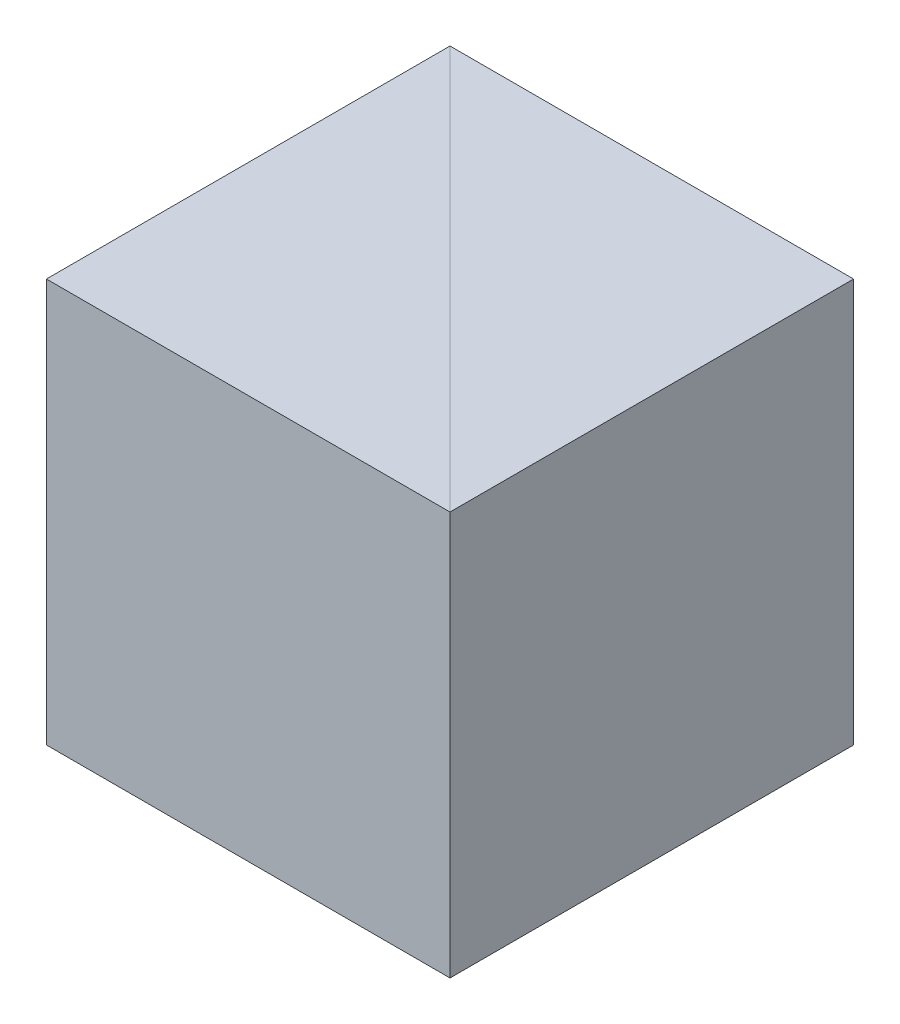
ISO-10303-21;
HEADER;
FILE_DESCRIPTION(('STEP AP214'),'2;1');
FILE_NAME('part.step','',(''),(''),'','','');
FILE_SCHEMA(('AUTOMOTIVE_DESIGN { 1 0 10303 214 1 1 1 1 }'));
ENDSEC;
DATA;
#1=APPLICATION_CONTEXT('core data for automotive mechanical design processes');
#2=APPLICATION_PROTOCOL_DEFINITION('international standard','automotive_design',2000,#1);
#3=PRODUCT_CONTEXT('',#1,'mechanical');
#4=PRODUCT('Part','Part','',(#3));
#5=PRODUCT_RELATED_PRODUCT_CATEGORY('part','',(#4));
#6=PRODUCT_DEFINITION_FORMATION('','',#4);
#7=PRODUCT_DEFINITION_CONTEXT('part definition',#1,'design');
#8=PRODUCT_DEFINITION('design','',#6,#7);
#9=PRODUCT_DEFINITION_SHAPE('','',#8);
#10=(LENGTH_UNIT() NAMED_UNIT(*) SI_UNIT(.MILLI.,.METRE.));
#11=(NAMED_UNIT(*) PLANE_ANGLE_UNIT() SI_UNIT($,.RADIAN.));
#12=(NAMED_UNIT(*) SI_UNIT($,.STERADIAN.) SOLID_ANGLE_UNIT());
#13=UNCERTAINTY_MEASURE_WITH_UNIT(LENGTH_MEASURE(1.E-05),#10,'distance_accuracy_value','');
#14=(GEOMETRIC_REPRESENTATION_CONTEXT(3) GLOBAL_UNCERTAINTY_ASSIGNED_CONTEXT((#13)) GLOBAL_UNIT_ASSIGNED_CONTEXT((#10,
#11,#12)) REPRESENTATION_CONTEXT('',''));
#15=CARTESIAN_POINT('',(0.,0.,0.));
#16=DIRECTION('',(0.,0.,1.));
#17=DIRECTION('',(1.,0.,0.));
#18=AXIS2_PLACEMENT_3D('',#15,#16,#17);
#19=CARTESIAN_POINT('',(0.,25.,0.));
#20=DIRECTION('',(0.707106781186547,0.,-0.707106781186547));
#21=DIRECTION('',(-0.707106781186548,0.,-0.707106781186548));
#22=AXIS2_PLACEMENT_3D('',#19,#20,#21);
#23=PLANE('',#22);
#24=DIRECTION('',(0.707106781186547,0.,0.707106781186547));
#25=VECTOR('',#24,1.);
#26=CARTESIAN_POINT('',(0.,0.,0.));
#27=LINE('',#26,#25);
#28=CARTESIAN_POINT('',(-25.,0.,-25.));
#29=VERTEX_POINT('',#28);
#30=CARTESIAN_POINT('',(0.,0.,0.));
#31=VERTEX_POINT('',#30);
#32=EDGE_CURVE('E99',#29,#31,#27,.T.);
#33=ORIENTED_EDGE('',*,*,#32,.F.);
#34=DIRECTION('',(0.,-1.,0.));
#35=VECTOR('',#34,1.);
#36=CARTESIAN_POINT('',(-25.,25.,-25.));
#37=LINE('',#36,#35);
#38=CARTESIAN_POINT('',(-25.,25.,-25.));
#39=VERTEX_POINT('',#38);
#40=EDGE_CURVE('E12',#39,#29,#37,.T.);
#41=ORIENTED_EDGE('',*,*,#40,.F.);
#42=DIRECTION('',(0.707106781186547,0.,0.707106781186547));
#43=VECTOR('',#42,1.);
#44=CARTESIAN_POINT('',(0.,25.,0.));
#45=LINE('',#44,#43);
#46=CARTESIAN_POINT('',(0.,25.,0.));
#47=VERTEX_POINT('',#46);
#48=EDGE_CURVE('E91',#39,#47,#45,.T.);
#49=ORIENTED_EDGE('',*,*,#48,.T.);
#50=DIRECTION('',(0.,-1.,0.));
#51=VECTOR('',#50,1.);
#52=CARTESIAN_POINT('',(0.,25.,0.));
#53=LINE('',#52,#51);
#54=EDGE_CURVE('E50',#47,#31,#53,.T.);
#55=ORIENTED_EDGE('',*,*,#54,.T.);
#56=EDGE_LOOP('',(#33,#41,#49,#55));
#57=FACE_BOUND('',#56,.T.);
#58=ADVANCED_FACE('F47',(#57),#23,.T.);
#59=CARTESIAN_POINT('',(-25.,25.,-25.));
#60=DIRECTION('',(-1.,0.,0.));
#61=DIRECTION('',(0.,0.,1.));
#62=AXIS2_PLACEMENT_3D('',#59,#60,#61);
#63=PLANE('',#62);
#64=DIRECTION('',(0.,0.,-1.));
#65=VECTOR('',#64,1.);
#66=CARTESIAN_POINT('',(-25.,0.,-25.));
#67=LINE('',#66,#65);
#68=CARTESIAN_POINT('',(-25.,0.,0.));
#69=VERTEX_POINT('',#68);
#70=EDGE_CURVE('E93',#69,#29,#67,.T.);
#71=ORIENTED_EDGE('',*,*,#70,.F.);
#72=DIRECTION('',(0.,-1.,0.));
#73=VECTOR('',#72,1.);
#74=CARTESIAN_POINT('',(-25.,25.,0.));
#75=LINE('',#74,#73);
#76=CARTESIAN_POINT('',(-25.,25.,0.));
#77=VERTEX_POINT('',#76);
#78=EDGE_CURVE('E56',#77,#69,#75,.T.);
#79=ORIENTED_EDGE('',*,*,#78,.F.);
#80=DIRECTION('',(0.,0.,-1.));
#81=VECTOR('',#80,1.);
#82=CARTESIAN_POINT('',(-25.,25.,-25.));
#83=LINE('',#82,#81);
#84=EDGE_CURVE('E88',#77,#39,#83,.T.);
#85=ORIENTED_EDGE('',*,*,#84,.T.);
#86=ORIENTED_EDGE('',*,*,#40,.T.);
#87=EDGE_LOOP('',(#71,#79,#85,#86));
#88=FACE_BOUND('',#87,.T.);
#89=ADVANCED_FACE('F103',(#88),#63,.T.);
#90=CARTESIAN_POINT('',(-25.,25.,0.));
#91=DIRECTION('',(0.,0.,1.));
#92=DIRECTION('',(1.,0.,0.));
#93=AXIS2_PLACEMENT_3D('',#90,#91,#92);
#94=PLANE('',#93);
#95=DIRECTION('',(-1.,0.,0.));
#96=VECTOR('',#95,1.);
#97=CARTESIAN_POINT('',(-25.,0.,0.));
#98=LINE('',#97,#96);
#99=EDGE_CURVE('E86',#31,#69,#98,.T.);
#100=ORIENTED_EDGE('',*,*,#99,.F.);
#101=ORIENTED_EDGE('',*,*,#54,.F.);
#102=DIRECTION('',(-1.,0.,0.));
#103=VECTOR('',#102,1.);
#104=CARTESIAN_POINT('',(-25.,25.,0.));
#105=LINE('',#104,#103);
#106=EDGE_CURVE('E84',#47,#77,#105,.T.);
#107=ORIENTED_EDGE('',*,*,#106,.T.);
#108=ORIENTED_EDGE('',*,*,#78,.T.);
#109=EDGE_LOOP('',(#100,#101,#107,#108));
#110=FACE_BOUND('',#109,.T.);
#111=ADVANCED_FACE('F83',(#110),#94,.T.);
#112=CARTESIAN_POINT('',(0.,25.,0.));
#113=DIRECTION('',(0.,1.,0.));
#114=DIRECTION('',(0.,0.,1.));
#115=AXIS2_PLACEMENT_3D('',#112,#113,#114);
#116=PLANE('',#115);
#117=ORIENTED_EDGE('',*,*,#48,.F.);
#118=ORIENTED_EDGE('',*,*,#84,.F.);
#119=ORIENTED_EDGE('',*,*,#106,.F.);
#120=EDGE_LOOP('',(#117,#118,#119));
#121=FACE_BOUND('',#120,.T.);
#122=ADVANCED_FACE('F90',(#121),#116,.T.);
#123=CARTESIAN_POINT('',(0.,0.,0.));
#124=DIRECTION('',(0.,1.,0.));
#125=DIRECTION('',(0.,0.,1.));
#126=AXIS2_PLACEMENT_3D('',#123,#124,#125);
#127=PLANE('',#126);
#128=ORIENTED_EDGE('',*,*,#32,.T.);
#129=ORIENTED_EDGE('',*,*,#99,.T.);
#130=ORIENTED_EDGE('',*,*,#70,.T.);
#131=EDGE_LOOP('',(#128,#129,#130));
#132=FACE_BOUND('',#131,.T.);
#133=ADVANCED_FACE('F102',(#132),#127,.F.);
#134=CLOSED_SHELL('',(#58,#89,#111,#122,#133));
#135=MANIFOLD_SOLID_BREP('B2',#134);
#136=CARTESIAN_POINT('',(-25.,25.,-25.));
#137=DIRECTION('',(0.707106781186547,0.,-0.707106781186547));
#138=DIRECTION('',(-0.707106781186548,0.,-0.707106781186548));
#139=AXIS2_PLACEMENT_3D('',#136,#137,#138);
#140=PLANE('',#139);
#141=DIRECTION('',(0.707106781186547,0.,0.707106781186547));
#142=VECTOR('',#141,1.);
#143=CARTESIAN_POINT('',(-25.,0.,-25.));
#144=LINE('',#143,#142);
#145=CARTESIAN_POINT('',(-25.,0.,-25.));
#146=VERTEX_POINT('',#145);
#147=CARTESIAN_POINT('',(0.,0.,0.));
#148=VERTEX_POINT('',#147);
#149=EDGE_CURVE('E192',#146,#148,#144,.T.);
#150=ORIENTED_EDGE('',*,*,#149,.T.);
#151=DIRECTION('',(0.,-1.,0.));
#152=VECTOR('',#151,1.);
#153=CARTESIAN_POINT('',(0.,25.,0.));
#154=LINE('',#153,#152);
#155=CARTESIAN_POINT('',(0.,25.,0.));
#156=VERTEX_POINT('',#155);
#157=EDGE_CURVE('E45',#156,#148,#154,.T.);
#158=ORIENTED_EDGE('',*,*,#157,.F.);
#159=DIRECTION('',(0.707106781186547,0.,0.707106781186547));
#160=VECTOR('',#159,1.);
#161=CARTESIAN_POINT('',(-25.,25.,-25.));
#162=LINE('',#161,#160);
#163=CARTESIAN_POINT('',(-25.,25.,-25.));
#164=VERTEX_POINT('',#163);
#165=EDGE_CURVE('E185',#164,#156,#162,.T.);
#166=ORIENTED_EDGE('',*,*,#165,.F.);
#167=DIRECTION('',(0.,-1.,0.));
#168=VECTOR('',#167,1.);
#169=CARTESIAN_POINT('',(-25.,25.,-25.));
#170=LINE('',#169,#168);
#171=EDGE_CURVE('E193',#164,#146,#170,.T.);
#172=ORIENTED_EDGE('',*,*,#171,.T.);
#173=EDGE_LOOP('',(#150,#158,#166,#172));
#174=FACE_BOUND('',#173,.T.);
#175=ADVANCED_FACE('F145',(#174),#140,.F.);
#176=CARTESIAN_POINT('',(0.,25.,0.));
#177=DIRECTION('',(-1.,0.,0.));
#178=DIRECTION('',(0.,0.,1.));
#179=AXIS2_PLACEMENT_3D('',#176,#177,#178);
#180=PLANE('',#179);
#181=DIRECTION('',(0.,0.,-1.));
#182=VECTOR('',#181,1.);
#183=CARTESIAN_POINT('',(0.,0.,0.));
#184=LINE('',#183,#182);
#185=CARTESIAN_POINT('',(0.,0.,-25.));
#186=VERTEX_POINT('',#185);
#187=EDGE_CURVE('E173',#148,#186,#184,.T.);
#188=ORIENTED_EDGE('',*,*,#187,.T.);
#189=DIRECTION('',(0.,-1.,0.));
#190=VECTOR('',#189,1.);
#191=CARTESIAN_POINT('',(0.,25.,-25.));
#192=LINE('',#191,#190);
#193=CARTESIAN_POINT('',(0.,25.,-25.));
#194=VERTEX_POINT('',#193);
#195=EDGE_CURVE('E153',#194,#186,#192,.T.);
#196=ORIENTED_EDGE('',*,*,#195,.F.);
#197=DIRECTION('',(0.,0.,-1.));
#198=VECTOR('',#197,1.);
#199=CARTESIAN_POINT('',(0.,25.,0.));
#200=LINE('',#199,#198);
#201=EDGE_CURVE('E181',#156,#194,#200,.T.);
#202=ORIENTED_EDGE('',*,*,#201,.F.);
#203=ORIENTED_EDGE('',*,*,#157,.T.);
#204=EDGE_LOOP('',(#188,#196,#202,#203));
#205=FACE_BOUND('',#204,.T.);
#206=ADVANCED_FACE('F182',(#205),#180,.F.);
#207=CARTESIAN_POINT('',(0.,25.,-25.));
#208=DIRECTION('',(0.,0.,1.));
#209=DIRECTION('',(1.,0.,0.));
#210=AXIS2_PLACEMENT_3D('',#207,#208,#209);
#211=PLANE('',#210);
#212=DIRECTION('',(-1.,0.,0.));
#213=VECTOR('',#212,1.);
#214=CARTESIAN_POINT('',(0.,0.,-25.));
#215=LINE('',#214,#213);
#216=EDGE_CURVE('E178',#186,#146,#215,.T.);
#217=ORIENTED_EDGE('',*,*,#216,.T.);
#218=ORIENTED_EDGE('',*,*,#171,.F.);
#219=DIRECTION('',(-1.,0.,0.));
#220=VECTOR('',#219,1.);
#221=CARTESIAN_POINT('',(0.,25.,-25.));
#222=LINE('',#221,#220);
#223=EDGE_CURVE('E161',#194,#164,#222,.T.);
#224=ORIENTED_EDGE('',*,*,#223,.F.);
#225=ORIENTED_EDGE('',*,*,#195,.T.);
#226=EDGE_LOOP('',(#217,#218,#224,#225));
#227=FACE_BOUND('',#226,.T.);
#228=ADVANCED_FACE('F200',(#227),#211,.F.);
#229=CARTESIAN_POINT('',(0.,25.,0.));
#230=DIRECTION('',(0.,1.,0.));
#231=DIRECTION('',(0.,0.,1.));
#232=AXIS2_PLACEMENT_3D('',#229,#230,#231);
#233=PLANE('',#232);
#234=ORIENTED_EDGE('',*,*,#165,.T.);
#235=ORIENTED_EDGE('',*,*,#201,.T.);
#236=ORIENTED_EDGE('',*,*,#223,.T.);
#237=EDGE_LOOP('',(#234,#235,#236));
#238=FACE_BOUND('',#237,.T.);
#239=ADVANCED_FACE('F188',(#238),#233,.T.);
#240=CARTESIAN_POINT('',(0.,0.,0.));
#241=DIRECTION('',(0.,1.,0.));
#242=DIRECTION('',(0.,0.,1.));
#243=AXIS2_PLACEMENT_3D('',#240,#241,#242);
#244=PLANE('',#243);
#245=ORIENTED_EDGE('',*,*,#149,.F.);
#246=ORIENTED_EDGE('',*,*,#216,.F.);
#247=ORIENTED_EDGE('',*,*,#187,.F.);
#248=EDGE_LOOP('',(#245,#246,#247));
#249=FACE_BOUND('',#248,.T.);
#250=ADVANCED_FACE('F201',(#249),#244,.F.);
#251=CLOSED_SHELL('',(#175,#206,#228,#239,#250));
#252=MANIFOLD_SOLID_BREP('B6',#251);
#253=ADVANCED_BREP_SHAPE_REPRESENTATION('',(#18,#135,#252),#14);
#254=SHAPE_DEFINITION_REPRESENTATION(#9,#253);
ENDSEC;
END-ISO-10303-21;
